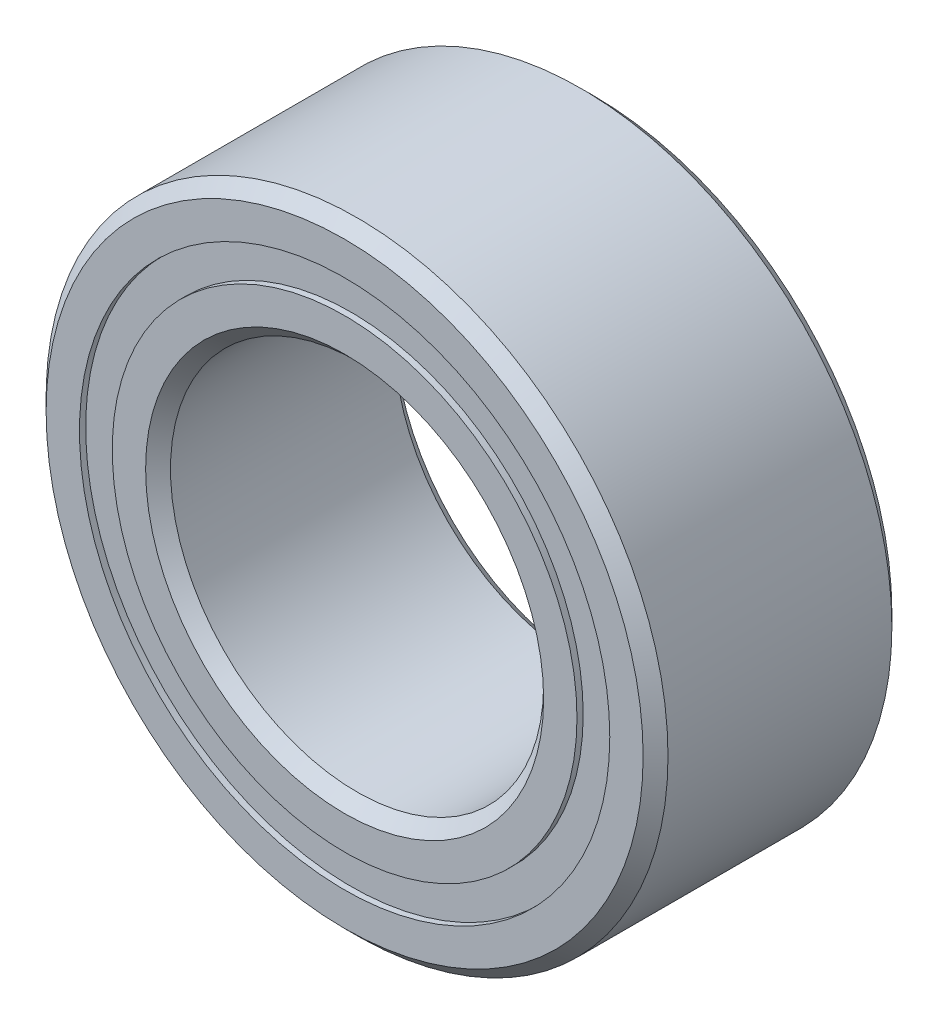
ISO-10303-21;
HEADER;
FILE_DESCRIPTION(('STEP AP214'),'2;1');
FILE_NAME('part.step','',(''),(''),'','','');
FILE_SCHEMA(('AUTOMOTIVE_DESIGN { 1 0 10303 214 1 1 1 1 }'));
ENDSEC;
DATA;
#1=APPLICATION_CONTEXT('core data for automotive mechanical design processes');
#2=APPLICATION_PROTOCOL_DEFINITION('international standard','automotive_design',2000,#1);
#3=PRODUCT_CONTEXT('',#1,'mechanical');
#4=PRODUCT('Part','Part','',(#3));
#5=PRODUCT_RELATED_PRODUCT_CATEGORY('part','',(#4));
#6=PRODUCT_DEFINITION_FORMATION('','',#4);
#7=PRODUCT_DEFINITION_CONTEXT('part definition',#1,'design');
#8=PRODUCT_DEFINITION('design','',#6,#7);
#9=PRODUCT_DEFINITION_SHAPE('','',#8);
#10=(LENGTH_UNIT() NAMED_UNIT(*) SI_UNIT(.MILLI.,.METRE.));
#11=(NAMED_UNIT(*) PLANE_ANGLE_UNIT() SI_UNIT($,.RADIAN.));
#12=(NAMED_UNIT(*) SI_UNIT($,.STERADIAN.) SOLID_ANGLE_UNIT());
#13=UNCERTAINTY_MEASURE_WITH_UNIT(LENGTH_MEASURE(1.E-05),#10,'distance_accuracy_value','');
#14=(GEOMETRIC_REPRESENTATION_CONTEXT(3) GLOBAL_UNCERTAINTY_ASSIGNED_CONTEXT((#13)) GLOBAL_UNIT_ASSIGNED_CONTEXT((#10,
#11,#12)) REPRESENTATION_CONTEXT('',''));
#15=CARTESIAN_POINT('',(0.,0.,0.));
#16=DIRECTION('',(0.,0.,1.));
#17=DIRECTION('',(1.,0.,0.));
#18=AXIS2_PLACEMENT_3D('',#15,#16,#17);
#19=CARTESIAN_POINT('',(0.,3.38434065934066,-1.508125));
#20=DIRECTION('',(0.,0.,1.));
#21=DIRECTION('',(1.,0.,0.));
#22=AXIS2_PLACEMENT_3D('',#19,#20,#21);
#23=PLANE('',#22);
#24=CARTESIAN_POINT('',(0.,0.,-1.508125));
#25=DIRECTION('',(0.,0.,1.));
#26=DIRECTION('',(1.,0.,0.));
#27=AXIS2_PLACEMENT_3D('',#24,#25,#26);
#28=CIRCLE('',#27,3.38434065934066);
#29=CARTESIAN_POINT('',(3.38434065934066,0.,-1.508125));
#30=VERTEX_POINT('',#29);
#31=EDGE_CURVE('E56',#30,#30,#28,.T.);
#32=ORIENTED_EDGE('',*,*,#31,.F.);
#33=EDGE_LOOP('',(#32));
#34=FACE_BOUND('',#33,.T.);
#35=CARTESIAN_POINT('',(0.,0.,-1.508125));
#36=DIRECTION('',(0.,0.,1.));
#37=DIRECTION('',(1.,0.,0.));
#38=AXIS2_PLACEMENT_3D('',#35,#36,#37);
#39=CIRCLE('',#38,2.96565934065934);
#40=CARTESIAN_POINT('',(2.96565934065934,0.,-1.508125));
#41=VERTEX_POINT('',#40);
#42=EDGE_CURVE('E11',#41,#41,#39,.T.);
#43=ORIENTED_EDGE('',*,*,#42,.T.);
#44=EDGE_LOOP('',(#43));
#45=FACE_BOUND('',#44,.T.);
#46=ADVANCED_FACE('F42',(#34,#45),#23,.F.);
#47=CARTESIAN_POINT('',(0.,0.,1.5875));
#48=DIRECTION('',(0.,0.,1.));
#49=DIRECTION('',(1.,0.,0.));
#50=AXIS2_PLACEMENT_3D('',#47,#48,#49);
#51=CYLINDRICAL_SURFACE('',#50,2.96565934065934);
#52=ORIENTED_EDGE('',*,*,#42,.F.);
#53=EDGE_LOOP('',(#52));
#54=FACE_BOUND('',#53,.T.);
#55=CARTESIAN_POINT('',(0.,0.,-0.735956624828183));
#56=DIRECTION('',(0.,0.,1.));
#57=DIRECTION('',(1.,0.,0.));
#58=AXIS2_PLACEMENT_3D('',#55,#56,#57);
#59=CIRCLE('',#58,2.96565934065934);
#60=CARTESIAN_POINT('',(2.96565934065934,0.,-0.735956624828183));
#61=VERTEX_POINT('',#60);
#62=EDGE_CURVE('E48',#61,#61,#59,.T.);
#63=ORIENTED_EDGE('',*,*,#62,.T.);
#64=EDGE_LOOP('',(#63));
#65=FACE_BOUND('',#64,.T.);
#66=ADVANCED_FACE('F65',(#54,#65),#51,.F.);
#67=CARTESIAN_POINT('',(0.,3.38434065934066,-0.735956624828183));
#68=DIRECTION('',(0.,0.,-1.));
#69=DIRECTION('',(-1.,0.,0.));
#70=AXIS2_PLACEMENT_3D('',#67,#68,#69);
#71=PLANE('',#70);
#72=ORIENTED_EDGE('',*,*,#62,.F.);
#73=EDGE_LOOP('',(#72));
#74=FACE_BOUND('',#73,.T.);
#75=CARTESIAN_POINT('',(0.,0.,-0.735956624828183));
#76=DIRECTION('',(0.,0.,1.));
#77=DIRECTION('',(1.,0.,0.));
#78=AXIS2_PLACEMENT_3D('',#75,#76,#77);
#79=CIRCLE('',#78,3.38434065934066);
#80=CARTESIAN_POINT('',(3.38434065934066,0.,-0.735956624828183));
#81=VERTEX_POINT('',#80);
#82=EDGE_CURVE('E52',#81,#81,#79,.T.);
#83=ORIENTED_EDGE('',*,*,#82,.T.);
#84=EDGE_LOOP('',(#83));
#85=FACE_BOUND('',#84,.T.);
#86=ADVANCED_FACE('F69',(#74,#85),#71,.F.);
#87=CARTESIAN_POINT('',(0.,0.,1.5875));
#88=DIRECTION('',(0.,0.,1.));
#89=DIRECTION('',(1.,0.,0.));
#90=AXIS2_PLACEMENT_3D('',#87,#88,#89);
#91=CYLINDRICAL_SURFACE('',#90,3.38434065934066);
#92=ORIENTED_EDGE('',*,*,#82,.F.);
#93=EDGE_LOOP('',(#92));
#94=FACE_BOUND('',#93,.T.);
#95=ORIENTED_EDGE('',*,*,#31,.T.);
#96=EDGE_LOOP('',(#95));
#97=FACE_BOUND('',#96,.T.);
#98=ADVANCED_FACE('F62',(#94,#97),#91,.T.);
#99=CLOSED_SHELL('',(#46,#66,#86,#98));
#100=MANIFOLD_SOLID_BREP('B2',#99);
#101=CARTESIAN_POINT('',(0.,3.38434065934066,1.508125));
#102=DIRECTION('',(0.,0.,-1.));
#103=DIRECTION('',(-1.,0.,0.));
#104=AXIS2_PLACEMENT_3D('',#101,#102,#103);
#105=PLANE('',#104);
#106=CARTESIAN_POINT('',(0.,0.,1.508125));
#107=DIRECTION('',(0.,0.,1.));
#108=DIRECTION('',(1.,0.,0.));
#109=AXIS2_PLACEMENT_3D('',#106,#107,#108);
#110=CIRCLE('',#109,2.96565934065934);
#111=CARTESIAN_POINT('',(2.96565934065934,0.,1.508125));
#112=VERTEX_POINT('',#111);
#113=EDGE_CURVE('E41',#112,#112,#110,.T.);
#114=ORIENTED_EDGE('',*,*,#113,.F.);
#115=EDGE_LOOP('',(#114));
#116=FACE_BOUND('',#115,.T.);
#117=CARTESIAN_POINT('',(0.,0.,1.508125));
#118=DIRECTION('',(0.,0.,1.));
#119=DIRECTION('',(1.,0.,0.));
#120=AXIS2_PLACEMENT_3D('',#117,#118,#119);
#121=CIRCLE('',#120,3.38434065934066);
#122=CARTESIAN_POINT('',(3.38434065934066,0.,1.508125));
#123=VERTEX_POINT('',#122);
#124=EDGE_CURVE('E124',#123,#123,#121,.T.);
#125=ORIENTED_EDGE('',*,*,#124,.T.);
#126=EDGE_LOOP('',(#125));
#127=FACE_BOUND('',#126,.T.);
#128=ADVANCED_FACE('F110',(#116,#127),#105,.F.);
#129=CARTESIAN_POINT('',(0.,0.,1.5875));
#130=DIRECTION('',(0.,0.,1.));
#131=DIRECTION('',(1.,0.,0.));
#132=AXIS2_PLACEMENT_3D('',#129,#130,#131);
#133=CYLINDRICAL_SURFACE('',#132,2.96565934065934);
#134=CARTESIAN_POINT('',(0.,0.,0.735956624828182));
#135=DIRECTION('',(0.,0.,1.));
#136=DIRECTION('',(1.,0.,0.));
#137=AXIS2_PLACEMENT_3D('',#134,#135,#136);
#138=CIRCLE('',#137,2.96565934065934);
#139=CARTESIAN_POINT('',(2.96565934065934,0.,0.735956624828182));
#140=VERTEX_POINT('',#139);
#141=EDGE_CURVE('E116',#140,#140,#138,.T.);
#142=ORIENTED_EDGE('',*,*,#141,.F.);
#143=EDGE_LOOP('',(#142));
#144=FACE_BOUND('',#143,.T.);
#145=ORIENTED_EDGE('',*,*,#113,.T.);
#146=EDGE_LOOP('',(#145));
#147=FACE_BOUND('',#146,.T.);
#148=ADVANCED_FACE('F139',(#144,#147),#133,.F.);
#149=CARTESIAN_POINT('',(0.,3.38434065934066,0.735956624828182));
#150=DIRECTION('',(0.,0.,1.));
#151=DIRECTION('',(1.,0.,0.));
#152=AXIS2_PLACEMENT_3D('',#149,#150,#151);
#153=PLANE('',#152);
#154=CARTESIAN_POINT('',(0.,0.,0.735956624828182));
#155=DIRECTION('',(0.,0.,1.));
#156=DIRECTION('',(1.,0.,0.));
#157=AXIS2_PLACEMENT_3D('',#154,#155,#156);
#158=CIRCLE('',#157,3.38434065934066);
#159=CARTESIAN_POINT('',(3.38434065934066,0.,0.735956624828182));
#160=VERTEX_POINT('',#159);
#161=EDGE_CURVE('E120',#160,#160,#158,.T.);
#162=ORIENTED_EDGE('',*,*,#161,.F.);
#163=EDGE_LOOP('',(#162));
#164=FACE_BOUND('',#163,.T.);
#165=ORIENTED_EDGE('',*,*,#141,.T.);
#166=EDGE_LOOP('',(#165));
#167=FACE_BOUND('',#166,.T.);
#168=ADVANCED_FACE('F134',(#164,#167),#153,.F.);
#169=CARTESIAN_POINT('',(0.,0.,1.5875));
#170=DIRECTION('',(0.,0.,1.));
#171=DIRECTION('',(1.,0.,0.));
#172=AXIS2_PLACEMENT_3D('',#169,#170,#171);
#173=CYLINDRICAL_SURFACE('',#172,3.38434065934066);
#174=ORIENTED_EDGE('',*,*,#124,.F.);
#175=EDGE_LOOP('',(#174));
#176=FACE_BOUND('',#175,.T.);
#177=ORIENTED_EDGE('',*,*,#161,.T.);
#178=EDGE_LOOP('',(#177));
#179=FACE_BOUND('',#178,.T.);
#180=ADVANCED_FACE('F131',(#176,#179),#173,.T.);
#181=CLOSED_SHELL('',(#128,#148,#168,#180));
#182=MANIFOLD_SOLID_BREP('B6',#181);
#183=CARTESIAN_POINT('',(-1.58749999999996,2.74963065701561,0.));
#184=DIRECTION('',(0.,0.,1.));
#185=DIRECTION('',(0.499999999999989,-0.866025403784445,0.));
#186=AXIS2_PLACEMENT_3D('',#183,#184,#185);
#187=SPHERICAL_SURFACE('',#186,0.735956624828183);
#188=CARTESIAN_POINT('',(-1.58749999999996,2.74963065701561,0.735956624828182));
#189=VERTEX_POINT('',#188);
#190=VERTEX_LOOP('',#189);
#191=FACE_BOUND('',#190,.T.);
#192=ADVANCED_FACE('F177',(#191),#187,.T.);
#193=CLOSED_SHELL('',(#192));
#194=MANIFOLD_SOLID_BREP('B36',#193);
#195=CARTESIAN_POINT('',(-2.74963065701557,1.58750000000003,0.));
#196=DIRECTION('',(0.,0.,1.));
#197=DIRECTION('',(0.866025403784433,-0.50000000000001,0.));
#198=AXIS2_PLACEMENT_3D('',#195,#196,#197);
#199=SPHERICAL_SURFACE('',#198,0.735956624828183);
#200=CARTESIAN_POINT('',(-2.74963065701557,1.58750000000003,0.735956624828182));
#201=VERTEX_POINT('',#200);
#202=VERTEX_LOOP('',#201);
#203=FACE_BOUND('',#202,.T.);
#204=ADVANCED_FACE('F197',(#203),#199,.T.);
#205=CLOSED_SHELL('',(#204));
#206=MANIFOLD_SOLID_BREP('B106',#205);
#207=CARTESIAN_POINT('',(-3.175,0.,0.));
#208=DIRECTION('',(0.,0.,1.));
#209=DIRECTION('',(1.,0.,0.));
#210=AXIS2_PLACEMENT_3D('',#207,#208,#209);
#211=SPHERICAL_SURFACE('',#210,0.735956624828183);
#212=CARTESIAN_POINT('',(-3.175,0.,0.735956624828182));
#213=VERTEX_POINT('',#212);
#214=VERTEX_LOOP('',#213);
#215=FACE_BOUND('',#214,.T.);
#216=ADVANCED_FACE('F217',(#215),#211,.T.);
#217=CLOSED_SHELL('',(#216));
#218=MANIFOLD_SOLID_BREP('B173',#217);
#219=CARTESIAN_POINT('',(-2.74963065701561,-1.58749999999997,0.));
#220=DIRECTION('',(0.,0.,1.));
#221=DIRECTION('',(0.866025403784443,0.499999999999992,0.));
#222=AXIS2_PLACEMENT_3D('',#219,#220,#221);
#223=SPHERICAL_SURFACE('',#222,0.735956624828183);
#224=CARTESIAN_POINT('',(-2.74963065701561,-1.58749999999997,0.735956624828182));
#225=VERTEX_POINT('',#224);
#226=VERTEX_LOOP('',#225);
#227=FACE_BOUND('',#226,.T.);
#228=ADVANCED_FACE('F237',(#227),#223,.T.);
#229=CLOSED_SHELL('',(#228));
#230=MANIFOLD_SOLID_BREP('B193',#229);
#231=CARTESIAN_POINT('',(-1.58750000000002,-2.74963065701558,0.));
#232=DIRECTION('',(0.,0.,1.));
#233=DIRECTION('',(0.500000000000007,0.866025403784435,0.));
#234=AXIS2_PLACEMENT_3D('',#231,#232,#233);
#235=SPHERICAL_SURFACE('',#234,0.735956624828183);
#236=CARTESIAN_POINT('',(-1.58750000000002,-2.74963065701558,0.735956624828182));
#237=VERTEX_POINT('',#236);
#238=VERTEX_LOOP('',#237);
#239=FACE_BOUND('',#238,.T.);
#240=ADVANCED_FACE('F257',(#239),#235,.T.);
#241=CLOSED_SHELL('',(#240));
#242=MANIFOLD_SOLID_BREP('B213',#241);
#243=CARTESIAN_POINT('',(0.,-3.175,0.));
#244=DIRECTION('',(0.,0.,1.));
#245=DIRECTION('',(0.,1.,0.));
#246=AXIS2_PLACEMENT_3D('',#243,#244,#245);
#247=SPHERICAL_SURFACE('',#246,0.735956624828183);
#248=CARTESIAN_POINT('',(0.,-3.175,0.735956624828182));
#249=VERTEX_POINT('',#248);
#250=VERTEX_LOOP('',#249);
#251=FACE_BOUND('',#250,.T.);
#252=ADVANCED_FACE('F277',(#251),#247,.T.);
#253=CLOSED_SHELL('',(#252));
#254=MANIFOLD_SOLID_BREP('B233',#253);
#255=CARTESIAN_POINT('',(1.58749999999998,-2.7496306570156,0.));
#256=DIRECTION('',(0.,0.,1.));
#257=DIRECTION('',(-0.499999999999995,0.866025403784442,0.));
#258=AXIS2_PLACEMENT_3D('',#255,#256,#257);
#259=SPHERICAL_SURFACE('',#258,0.735956624828183);
#260=CARTESIAN_POINT('',(1.58749999999998,-2.7496306570156,0.735956624828182));
#261=VERTEX_POINT('',#260);
#262=VERTEX_LOOP('',#261);
#263=FACE_BOUND('',#262,.T.);
#264=ADVANCED_FACE('F297',(#263),#259,.T.);
#265=CLOSED_SHELL('',(#264));
#266=MANIFOLD_SOLID_BREP('B253',#265);
#267=CARTESIAN_POINT('',(2.74963065701559,-1.58750000000001,0.));
#268=DIRECTION('',(0.,0.,1.));
#269=DIRECTION('',(-0.866025403784436,0.500000000000004,0.));
#270=AXIS2_PLACEMENT_3D('',#267,#268,#269);
#271=SPHERICAL_SURFACE('',#270,0.735956624828183);
#272=CARTESIAN_POINT('',(2.74963065701559,-1.58750000000001,0.735956624828182));
#273=VERTEX_POINT('',#272);
#274=VERTEX_LOOP('',#273);
#275=FACE_BOUND('',#274,.T.);
#276=ADVANCED_FACE('F317',(#275),#271,.T.);
#277=CLOSED_SHELL('',(#276));
#278=MANIFOLD_SOLID_BREP('B273',#277);
#279=CARTESIAN_POINT('',(3.175,0.,0.));
#280=DIRECTION('',(0.,0.,1.));
#281=DIRECTION('',(-1.,0.,0.));
#282=AXIS2_PLACEMENT_3D('',#279,#280,#281);
#283=SPHERICAL_SURFACE('',#282,0.735956624828183);
#284=CARTESIAN_POINT('',(3.175,0.,0.735956624828182));
#285=VERTEX_POINT('',#284);
#286=VERTEX_LOOP('',#285);
#287=FACE_BOUND('',#286,.T.);
#288=ADVANCED_FACE('F337',(#287),#283,.T.);
#289=CLOSED_SHELL('',(#288));
#290=MANIFOLD_SOLID_BREP('B293',#289);
#291=CARTESIAN_POINT('',(2.7496306570156,1.58749999999999,0.));
#292=DIRECTION('',(0.,0.,1.));
#293=DIRECTION('',(-0.86602540378444,-0.499999999999998,0.));
#294=AXIS2_PLACEMENT_3D('',#291,#292,#293);
#295=SPHERICAL_SURFACE('',#294,0.735956624828183);
#296=CARTESIAN_POINT('',(2.7496306570156,1.58749999999999,0.735956624828182));
#297=VERTEX_POINT('',#296);
#298=VERTEX_LOOP('',#297);
#299=FACE_BOUND('',#298,.T.);
#300=ADVANCED_FACE('F357',(#299),#295,.T.);
#301=CLOSED_SHELL('',(#300));
#302=MANIFOLD_SOLID_BREP('B313',#301);
#303=CARTESIAN_POINT('',(1.5875,2.74963065701559,0.));
#304=DIRECTION('',(0.,0.,1.));
#305=DIRECTION('',(-0.500000000000001,-0.866025403784438,0.));
#306=AXIS2_PLACEMENT_3D('',#303,#304,#305);
#307=SPHERICAL_SURFACE('',#306,0.735956624828183);
#308=CARTESIAN_POINT('',(1.5875,2.74963065701559,0.735956624828182));
#309=VERTEX_POINT('',#308);
#310=VERTEX_LOOP('',#309);
#311=FACE_BOUND('',#310,.T.);
#312=ADVANCED_FACE('F377',(#311),#307,.T.);
#313=CLOSED_SHELL('',(#312));
#314=MANIFOLD_SOLID_BREP('B333',#313);
#315=CARTESIAN_POINT('',(0.,3.175,0.));
#316=DIRECTION('',(0.,0.,1.));
#317=DIRECTION('',(0.,-1.,0.));
#318=AXIS2_PLACEMENT_3D('',#315,#316,#317);
#319=SPHERICAL_SURFACE('',#318,0.735956624828183);
#320=CARTESIAN_POINT('',(0.,3.175,0.735956624828182));
#321=VERTEX_POINT('',#320);
#322=VERTEX_LOOP('',#321);
#323=FACE_BOUND('',#322,.T.);
#324=ADVANCED_FACE('F400',(#323),#319,.T.);
#325=CLOSED_SHELL('',(#324));
#326=MANIFOLD_SOLID_BREP('B353',#325);
#327=CARTESIAN_POINT('',(0.,2.96565934065934,1.5875));
#328=DIRECTION('',(0.,0.,-1.));
#329=DIRECTION('',(-1.,0.,0.));
#330=AXIS2_PLACEMENT_3D('',#327,#328,#329);
#331=PLANE('',#330);
#332=CARTESIAN_POINT('',(0.,0.,1.5875));
#333=DIRECTION('',(0.,0.,1.));
#334=DIRECTION('',(1.,0.,0.));
#335=AXIS2_PLACEMENT_3D('',#332,#333,#334);
#336=CIRCLE('',#335,2.54);
#337=CARTESIAN_POINT('',(2.54,0.,1.5875));
#338=VERTEX_POINT('',#337);
#339=EDGE_CURVE('E448',#338,#338,#336,.T.);
#340=ORIENTED_EDGE('',*,*,#339,.F.);
#341=EDGE_LOOP('',(#340));
#342=FACE_BOUND('',#341,.T.);
#343=CARTESIAN_POINT('',(0.,0.,1.5875));
#344=DIRECTION('',(0.,0.,1.));
#345=DIRECTION('',(1.,0.,0.));
#346=AXIS2_PLACEMENT_3D('',#343,#344,#345);
#347=CIRCLE('',#346,2.96565934065934);
#348=CARTESIAN_POINT('',(2.96565934065934,0.,1.5875));
#349=VERTEX_POINT('',#348);
#350=EDGE_CURVE('E399',#349,#349,#347,.T.);
#351=ORIENTED_EDGE('',*,*,#350,.T.);
#352=EDGE_LOOP('',(#351));
#353=FACE_BOUND('',#352,.T.);
#354=ADVANCED_FACE('F420',(#342,#353),#331,.F.);
#355=CARTESIAN_POINT('',(0.,0.,1.5875));
#356=DIRECTION('',(0.,0.,1.));
#357=DIRECTION('',(1.,0.,0.));
#358=AXIS2_PLACEMENT_3D('',#355,#356,#357);
#359=CYLINDRICAL_SURFACE('',#358,2.96565934065934);
#360=ORIENTED_EDGE('',*,*,#350,.F.);
#361=EDGE_LOOP('',(#360));
#362=FACE_BOUND('',#361,.T.);
#363=CARTESIAN_POINT('',(0.,0.,0.705555555555556));
#364=DIRECTION('',(0.,0.,1.));
#365=DIRECTION('',(1.,0.,0.));
#366=AXIS2_PLACEMENT_3D('',#363,#364,#365);
#367=CIRCLE('',#366,2.96565934065934);
#368=CARTESIAN_POINT('',(2.96565934065934,0.,0.705555555555556));
#369=VERTEX_POINT('',#368);
#370=EDGE_CURVE('E426',#369,#369,#367,.T.);
#371=ORIENTED_EDGE('',*,*,#370,.T.);
#372=EDGE_LOOP('',(#371));
#373=FACE_BOUND('',#372,.T.);
#374=ADVANCED_FACE('F455',(#362,#373),#359,.T.);
#375=CARTESIAN_POINT('',(0.,0.,0.));
#376=DIRECTION('',(0.,0.,1.));
#377=DIRECTION('',(1.,0.,0.));
#378=AXIS2_PLACEMENT_3D('',#375,#376,#377);
#379=TOROIDAL_SURFACE('',#378,3.17499999999999,0.735956624828181);
#380=ORIENTED_EDGE('',*,*,#370,.F.);
#381=EDGE_LOOP('',(#380));
#382=FACE_BOUND('',#381,.T.);
#383=CARTESIAN_POINT('',(0.,0.,-0.705555555555557));
#384=DIRECTION('',(0.,0.,1.));
#385=DIRECTION('',(1.,0.,0.));
#386=AXIS2_PLACEMENT_3D('',#383,#384,#385);
#387=CIRCLE('',#386,2.96565934065934);
#388=CARTESIAN_POINT('',(2.96565934065934,0.,-0.705555555555557));
#389=VERTEX_POINT('',#388);
#390=EDGE_CURVE('E430',#389,#389,#387,.T.);
#391=ORIENTED_EDGE('',*,*,#390,.T.);
#392=EDGE_LOOP('',(#391));
#393=FACE_BOUND('',#392,.T.);
#394=ADVANCED_FACE('F459',(#382,#393),#379,.F.);
#395=CARTESIAN_POINT('',(0.,0.,1.5875));
#396=DIRECTION('',(0.,0.,1.));
#397=DIRECTION('',(1.,0.,0.));
#398=AXIS2_PLACEMENT_3D('',#395,#396,#397);
#399=CYLINDRICAL_SURFACE('',#398,2.96565934065934);
#400=ORIENTED_EDGE('',*,*,#390,.F.);
#401=EDGE_LOOP('',(#400));
#402=FACE_BOUND('',#401,.T.);
#403=CARTESIAN_POINT('',(0.,0.,-1.5875));
#404=DIRECTION('',(0.,0.,1.));
#405=DIRECTION('',(1.,0.,0.));
#406=AXIS2_PLACEMENT_3D('',#403,#404,#405);
#407=CIRCLE('',#406,2.96565934065934);
#408=CARTESIAN_POINT('',(2.96565934065934,0.,-1.5875));
#409=VERTEX_POINT('',#408);
#410=EDGE_CURVE('E434',#409,#409,#407,.T.);
#411=ORIENTED_EDGE('',*,*,#410,.T.);
#412=EDGE_LOOP('',(#411));
#413=FACE_BOUND('',#412,.T.);
#414=ADVANCED_FACE('F464',(#402,#413),#399,.T.);
#415=CARTESIAN_POINT('',(0.,2.54,-1.5875));
#416=DIRECTION('',(0.,0.,1.));
#417=DIRECTION('',(1.,0.,0.));
#418=AXIS2_PLACEMENT_3D('',#415,#416,#417);
#419=PLANE('',#418);
#420=ORIENTED_EDGE('',*,*,#410,.F.);
#421=EDGE_LOOP('',(#420));
#422=FACE_BOUND('',#421,.T.);
#423=CARTESIAN_POINT('',(0.,0.,-1.5875));
#424=DIRECTION('',(0.,0.,1.));
#425=DIRECTION('',(1.,0.,0.));
#426=AXIS2_PLACEMENT_3D('',#423,#424,#425);
#427=CIRCLE('',#426,2.54);
#428=CARTESIAN_POINT('',(2.54,0.,-1.5875));
#429=VERTEX_POINT('',#428);
#430=EDGE_CURVE('E439',#429,#429,#427,.T.);
#431=ORIENTED_EDGE('',*,*,#430,.T.);
#432=EDGE_LOOP('',(#431));
#433=FACE_BOUND('',#432,.T.);
#434=ADVANCED_FACE('F470',(#422,#433),#419,.F.);
#435=CARTESIAN_POINT('',(0.,0.,-1.42875));
#436=DIRECTION('',(0.,0.,-1.));
#437=DIRECTION('',(-1.,0.,0.));
#438=AXIS2_PLACEMENT_3D('',#435,#436,#437);
#439=CONICAL_SURFACE('',#438,2.38125,0.785398163397446);
#440=ORIENTED_EDGE('',*,*,#430,.F.);
#441=EDGE_LOOP('',(#440));
#442=FACE_BOUND('',#441,.T.);
#443=CARTESIAN_POINT('',(0.,0.,-1.42875));
#444=DIRECTION('',(0.,0.,1.));
#445=DIRECTION('',(1.,0.,0.));
#446=AXIS2_PLACEMENT_3D('',#443,#444,#445);
#447=CIRCLE('',#446,2.38125);
#448=CARTESIAN_POINT('',(2.38125,0.,-1.42875));
#449=VERTEX_POINT('',#448);
#450=EDGE_CURVE('E442',#449,#449,#447,.T.);
#451=ORIENTED_EDGE('',*,*,#450,.T.);
#452=EDGE_LOOP('',(#451));
#453=FACE_BOUND('',#452,.T.);
#454=ADVANCED_FACE('F474',(#442,#453),#439,.F.);
#455=CARTESIAN_POINT('',(0.,0.,1.5875));
#456=DIRECTION('',(0.,0.,1.));
#457=DIRECTION('',(1.,0.,0.));
#458=AXIS2_PLACEMENT_3D('',#455,#456,#457);
#459=CYLINDRICAL_SURFACE('',#458,2.38125);
#460=ORIENTED_EDGE('',*,*,#450,.F.);
#461=EDGE_LOOP('',(#460));
#462=FACE_BOUND('',#461,.T.);
#463=CARTESIAN_POINT('',(0.,0.,1.42875));
#464=DIRECTION('',(0.,0.,1.));
#465=DIRECTION('',(1.,0.,0.));
#466=AXIS2_PLACEMENT_3D('',#463,#464,#465);
#467=CIRCLE('',#466,2.38125);
#468=CARTESIAN_POINT('',(2.38125,0.,1.42875));
#469=VERTEX_POINT('',#468);
#470=EDGE_CURVE('E445',#469,#469,#467,.T.);
#471=ORIENTED_EDGE('',*,*,#470,.T.);
#472=EDGE_LOOP('',(#471));
#473=FACE_BOUND('',#472,.T.);
#474=ADVANCED_FACE('F478',(#462,#473),#459,.F.);
#475=CARTESIAN_POINT('',(0.,0.,1.5875));
#476=DIRECTION('',(0.,0.,1.));
#477=DIRECTION('',(1.,0.,0.));
#478=AXIS2_PLACEMENT_3D('',#475,#476,#477);
#479=CONICAL_SURFACE('',#478,2.54,0.785398163397452);
#480=ORIENTED_EDGE('',*,*,#470,.F.);
#481=EDGE_LOOP('',(#480));
#482=FACE_BOUND('',#481,.T.);
#483=ORIENTED_EDGE('',*,*,#339,.T.);
#484=EDGE_LOOP('',(#483));
#485=FACE_BOUND('',#484,.T.);
#486=ADVANCED_FACE('F452',(#482,#485),#479,.F.);
#487=CLOSED_SHELL('',(#354,#374,#394,#414,#434,#454,#474,#486));
#488=MANIFOLD_SOLID_BREP('B373',#487);
#489=CARTESIAN_POINT('',(0.,0.,1.42875));
#490=DIRECTION('',(0.,0.,-1.));
#491=DIRECTION('',(-1.,0.,0.));
#492=AXIS2_PLACEMENT_3D('',#489,#490,#491);
#493=CONICAL_SURFACE('',#492,3.96875,0.78539816339745);
#494=CARTESIAN_POINT('',(0.,0.,1.5875));
#495=DIRECTION('',(0.,0.,1.));
#496=DIRECTION('',(1.,0.,0.));
#497=AXIS2_PLACEMENT_3D('',#494,#495,#496);
#498=CIRCLE('',#497,3.81);
#499=CARTESIAN_POINT('',(3.81,0.,1.5875));
#500=VERTEX_POINT('',#499);
#501=EDGE_CURVE('E570',#500,#500,#498,.T.);
#502=ORIENTED_EDGE('',*,*,#501,.F.);
#503=EDGE_LOOP('',(#502));
#504=FACE_BOUND('',#503,.T.);
#505=CARTESIAN_POINT('',(0.,0.,1.42875));
#506=DIRECTION('',(0.,0.,1.));
#507=DIRECTION('',(1.,0.,0.));
#508=AXIS2_PLACEMENT_3D('',#505,#506,#507);
#509=CIRCLE('',#508,3.96875);
#510=CARTESIAN_POINT('',(3.96875,0.,1.42875));
#511=VERTEX_POINT('',#510);
#512=EDGE_CURVE('E419',#511,#511,#509,.T.);
#513=ORIENTED_EDGE('',*,*,#512,.T.);
#514=EDGE_LOOP('',(#513));
#515=FACE_BOUND('',#514,.T.);
#516=ADVANCED_FACE('F542',(#504,#515),#493,.T.);
#517=CARTESIAN_POINT('',(0.,0.,1.5875));
#518=DIRECTION('',(0.,0.,1.));
#519=DIRECTION('',(1.,0.,0.));
#520=AXIS2_PLACEMENT_3D('',#517,#518,#519);
#521=CYLINDRICAL_SURFACE('',#520,3.96875);
#522=ORIENTED_EDGE('',*,*,#512,.F.);
#523=EDGE_LOOP('',(#522));
#524=FACE_BOUND('',#523,.T.);
#525=CARTESIAN_POINT('',(0.,0.,-1.42875));
#526=DIRECTION('',(0.,0.,1.));
#527=DIRECTION('',(1.,0.,0.));
#528=AXIS2_PLACEMENT_3D('',#525,#526,#527);
#529=CIRCLE('',#528,3.96875);
#530=CARTESIAN_POINT('',(3.96875,0.,-1.42875));
#531=VERTEX_POINT('',#530);
#532=EDGE_CURVE('E548',#531,#531,#529,.T.);
#533=ORIENTED_EDGE('',*,*,#532,.T.);
#534=EDGE_LOOP('',(#533));
#535=FACE_BOUND('',#534,.T.);
#536=ADVANCED_FACE('F577',(#524,#535),#521,.T.);
#537=CARTESIAN_POINT('',(0.,0.,-1.5875));
#538=DIRECTION('',(0.,0.,1.));
#539=DIRECTION('',(1.,0.,0.));
#540=AXIS2_PLACEMENT_3D('',#537,#538,#539);
#541=CONICAL_SURFACE('',#540,3.81,0.785398163397448);
#542=ORIENTED_EDGE('',*,*,#532,.F.);
#543=EDGE_LOOP('',(#542));
#544=FACE_BOUND('',#543,.T.);
#545=CARTESIAN_POINT('',(0.,0.,-1.5875));
#546=DIRECTION('',(0.,0.,1.));
#547=DIRECTION('',(1.,0.,0.));
#548=AXIS2_PLACEMENT_3D('',#545,#546,#547);
#549=CIRCLE('',#548,3.81);
#550=CARTESIAN_POINT('',(3.81,0.,-1.5875));
#551=VERTEX_POINT('',#550);
#552=EDGE_CURVE('E552',#551,#551,#549,.T.);
#553=ORIENTED_EDGE('',*,*,#552,.T.);
#554=EDGE_LOOP('',(#553));
#555=FACE_BOUND('',#554,.T.);
#556=ADVANCED_FACE('F581',(#544,#555),#541,.T.);
#557=CARTESIAN_POINT('',(0.,3.81,-1.5875));
#558=DIRECTION('',(0.,0.,1.));
#559=DIRECTION('',(1.,0.,0.));
#560=AXIS2_PLACEMENT_3D('',#557,#558,#559);
#561=PLANE('',#560);
#562=ORIENTED_EDGE('',*,*,#552,.F.);
#563=EDGE_LOOP('',(#562));
#564=FACE_BOUND('',#563,.T.);
#565=CARTESIAN_POINT('',(0.,0.,-1.5875));
#566=DIRECTION('',(0.,0.,1.));
#567=DIRECTION('',(1.,0.,0.));
#568=AXIS2_PLACEMENT_3D('',#565,#566,#567);
#569=CIRCLE('',#568,3.38434065934066);
#570=CARTESIAN_POINT('',(3.38434065934066,0.,-1.5875));
#571=VERTEX_POINT('',#570);
#572=EDGE_CURVE('E556',#571,#571,#569,.T.);
#573=ORIENTED_EDGE('',*,*,#572,.T.);
#574=EDGE_LOOP('',(#573));
#575=FACE_BOUND('',#574,.T.);
#576=ADVANCED_FACE('F586',(#564,#575),#561,.F.);
#577=CARTESIAN_POINT('',(0.,0.,1.5875));
#578=DIRECTION('',(0.,0.,1.));
#579=DIRECTION('',(1.,0.,0.));
#580=AXIS2_PLACEMENT_3D('',#577,#578,#579);
#581=CYLINDRICAL_SURFACE('',#580,3.38434065934066);
#582=ORIENTED_EDGE('',*,*,#572,.F.);
#583=EDGE_LOOP('',(#582));
#584=FACE_BOUND('',#583,.T.);
#585=CARTESIAN_POINT('',(0.,0.,-0.705555555555556));
#586=DIRECTION('',(0.,0.,1.));
#587=DIRECTION('',(1.,0.,0.));
#588=AXIS2_PLACEMENT_3D('',#585,#586,#587);
#589=CIRCLE('',#588,3.38434065934066);
#590=CARTESIAN_POINT('',(3.38434065934066,0.,-0.705555555555556));
#591=VERTEX_POINT('',#590);
#592=EDGE_CURVE('E561',#591,#591,#589,.T.);
#593=ORIENTED_EDGE('',*,*,#592,.T.);
#594=EDGE_LOOP('',(#593));
#595=FACE_BOUND('',#594,.T.);
#596=ADVANCED_FACE('F592',(#584,#595),#581,.F.);
#597=CARTESIAN_POINT('',(0.,0.,0.));
#598=DIRECTION('',(0.,0.,1.));
#599=DIRECTION('',(1.,0.,0.));
#600=AXIS2_PLACEMENT_3D('',#597,#598,#599);
#601=TOROIDAL_SURFACE('',#600,3.175,0.735956624828183);
#602=ORIENTED_EDGE('',*,*,#592,.F.);
#603=EDGE_LOOP('',(#602));
#604=FACE_BOUND('',#603,.T.);
#605=CARTESIAN_POINT('',(0.,0.,0.705555555555555));
#606=DIRECTION('',(0.,0.,1.));
#607=DIRECTION('',(1.,0.,0.));
#608=AXIS2_PLACEMENT_3D('',#605,#606,#607);
#609=CIRCLE('',#608,3.38434065934066);
#610=CARTESIAN_POINT('',(3.38434065934066,0.,0.705555555555555));
#611=VERTEX_POINT('',#610);
#612=EDGE_CURVE('E564',#611,#611,#609,.T.);
#613=ORIENTED_EDGE('',*,*,#612,.T.);
#614=EDGE_LOOP('',(#613));
#615=FACE_BOUND('',#614,.T.);
#616=ADVANCED_FACE('F596',(#604,#615),#601,.F.);
#617=CARTESIAN_POINT('',(0.,0.,1.5875));
#618=DIRECTION('',(0.,0.,1.));
#619=DIRECTION('',(1.,0.,0.));
#620=AXIS2_PLACEMENT_3D('',#617,#618,#619);
#621=CYLINDRICAL_SURFACE('',#620,3.38434065934066);
#622=ORIENTED_EDGE('',*,*,#612,.F.);
#623=EDGE_LOOP('',(#622));
#624=FACE_BOUND('',#623,.T.);
#625=CARTESIAN_POINT('',(0.,0.,1.5875));
#626=DIRECTION('',(0.,0.,1.));
#627=DIRECTION('',(1.,0.,0.));
#628=AXIS2_PLACEMENT_3D('',#625,#626,#627);
#629=CIRCLE('',#628,3.38434065934066);
#630=CARTESIAN_POINT('',(3.38434065934066,0.,1.5875));
#631=VERTEX_POINT('',#630);
#632=EDGE_CURVE('E567',#631,#631,#629,.T.);
#633=ORIENTED_EDGE('',*,*,#632,.T.);
#634=EDGE_LOOP('',(#633));
#635=FACE_BOUND('',#634,.T.);
#636=ADVANCED_FACE('F600',(#624,#635),#621,.F.);
#637=CARTESIAN_POINT('',(0.,3.81,1.5875));
#638=DIRECTION('',(0.,0.,-1.));
#639=DIRECTION('',(-1.,0.,0.));
#640=AXIS2_PLACEMENT_3D('',#637,#638,#639);
#641=PLANE('',#640);
#642=ORIENTED_EDGE('',*,*,#632,.F.);
#643=EDGE_LOOP('',(#642));
#644=FACE_BOUND('',#643,.T.);
#645=ORIENTED_EDGE('',*,*,#501,.T.);
#646=EDGE_LOOP('',(#645));
#647=FACE_BOUND('',#646,.T.);
#648=ADVANCED_FACE('F574',(#644,#647),#641,.F.);
#649=CLOSED_SHELL('',(#516,#536,#556,#576,#596,#616,#636,#648));
#650=MANIFOLD_SOLID_BREP('B394',#649);
#651=ADVANCED_BREP_SHAPE_REPRESENTATION('',(#18,#100,#182,#194,#206,#218,#230,#242,#254,#266,
#278,#290,#302,#314,#326,#488,#650),#14);
#652=SHAPE_DEFINITION_REPRESENTATION(#9,#651);
ENDSEC;
END-ISO-10303-21;
